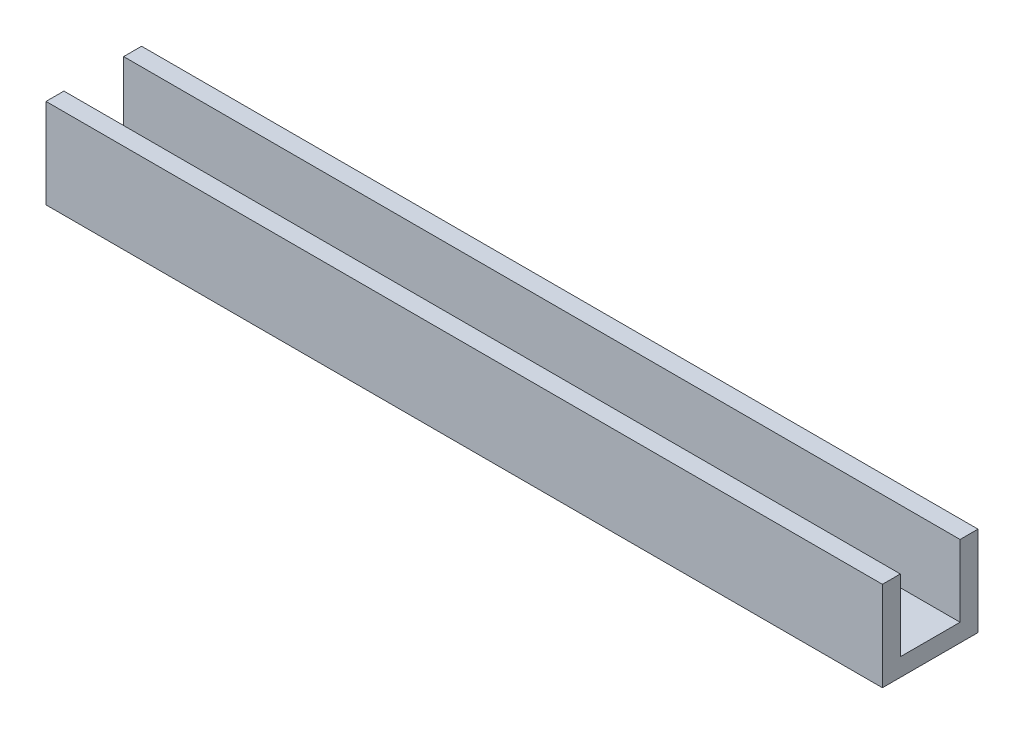
ISO-10303-21;
HEADER;
FILE_DESCRIPTION(('STEP AP214'),'2;1');
FILE_NAME('part.step','',(''),(''),'','','');
FILE_SCHEMA(('AUTOMOTIVE_DESIGN { 1 0 10303 214 1 1 1 1 }'));
ENDSEC;
DATA;
#1=APPLICATION_CONTEXT('core data for automotive mechanical design processes');
#2=APPLICATION_PROTOCOL_DEFINITION('international standard','automotive_design',2000,#1);
#3=PRODUCT_CONTEXT('',#1,'mechanical');
#4=PRODUCT('Part','Part','',(#3));
#5=PRODUCT_RELATED_PRODUCT_CATEGORY('part','',(#4));
#6=PRODUCT_DEFINITION_FORMATION('','',#4);
#7=PRODUCT_DEFINITION_CONTEXT('part definition',#1,'design');
#8=PRODUCT_DEFINITION('design','',#6,#7);
#9=PRODUCT_DEFINITION_SHAPE('','',#8);
#10=(LENGTH_UNIT() NAMED_UNIT(*) SI_UNIT(.MILLI.,.METRE.));
#11=(NAMED_UNIT(*) PLANE_ANGLE_UNIT() SI_UNIT($,.RADIAN.));
#12=(NAMED_UNIT(*) SI_UNIT($,.STERADIAN.) SOLID_ANGLE_UNIT());
#13=UNCERTAINTY_MEASURE_WITH_UNIT(LENGTH_MEASURE(1.E-05),#10,'distance_accuracy_value','');
#14=(GEOMETRIC_REPRESENTATION_CONTEXT(3) GLOBAL_UNCERTAINTY_ASSIGNED_CONTEXT((#13)) GLOBAL_UNIT_ASSIGNED_CONTEXT((#10,
#11,#12)) REPRESENTATION_CONTEXT('',''));
#15=CARTESIAN_POINT('',(0.,0.,0.));
#16=DIRECTION('',(0.,0.,1.));
#17=DIRECTION('',(1.,0.,0.));
#18=AXIS2_PLACEMENT_3D('',#15,#16,#17);
#19=CARTESIAN_POINT('',(70.,3.,0.));
#20=DIRECTION('',(-1.,0.,0.));
#21=DIRECTION('',(0.,0.,1.));
#22=AXIS2_PLACEMENT_3D('',#19,#20,#21);
#23=PLANE('',#22);
#24=DIRECTION('',(0.,0.,-1.));
#25=VECTOR('',#24,1.);
#26=CARTESIAN_POINT('',(70.,0.,0.));
#27=LINE('',#26,#25);
#28=CARTESIAN_POINT('',(70.,0.,8.));
#29=VERTEX_POINT('',#28);
#30=CARTESIAN_POINT('',(70.,0.,-8.));
#31=VERTEX_POINT('',#30);
#32=EDGE_CURVE('E182',#29,#31,#27,.T.);
#33=ORIENTED_EDGE('',*,*,#32,.T.);
#34=DIRECTION('',(0.,-1.,0.));
#35=VECTOR('',#34,1.);
#36=CARTESIAN_POINT('',(70.,15.,-8.));
#37=LINE('',#36,#35);
#38=CARTESIAN_POINT('',(70.,15.,-8.));
#39=VERTEX_POINT('',#38);
#40=EDGE_CURVE('E116',#39,#31,#37,.T.);
#41=ORIENTED_EDGE('',*,*,#40,.F.);
#42=DIRECTION('',(0.,0.,-1.));
#43=VECTOR('',#42,1.);
#44=CARTESIAN_POINT('',(70.,15.,0.));
#45=LINE('',#44,#43);
#46=CARTESIAN_POINT('',(70.,15.,-5.));
#47=VERTEX_POINT('',#46);
#48=EDGE_CURVE('E119',#47,#39,#45,.T.);
#49=ORIENTED_EDGE('',*,*,#48,.F.);
#50=DIRECTION('',(0.,-1.,0.));
#51=VECTOR('',#50,1.);
#52=CARTESIAN_POINT('',(70.,15.,-5.));
#53=LINE('',#52,#51);
#54=CARTESIAN_POINT('',(70.,3.,-5.));
#55=VERTEX_POINT('',#54);
#56=EDGE_CURVE('E107',#47,#55,#53,.T.);
#57=ORIENTED_EDGE('',*,*,#56,.T.);
#58=DIRECTION('',(0.,0.,-1.));
#59=VECTOR('',#58,1.);
#60=CARTESIAN_POINT('',(70.,3.,0.));
#61=LINE('',#60,#59);
#62=CARTESIAN_POINT('',(70.,3.,5.));
#63=VERTEX_POINT('',#62);
#64=EDGE_CURVE('E58',#63,#55,#61,.T.);
#65=ORIENTED_EDGE('',*,*,#64,.F.);
#66=DIRECTION('',(0.,-1.,0.));
#67=VECTOR('',#66,1.);
#68=CARTESIAN_POINT('',(70.,15.,5.));
#69=LINE('',#68,#67);
#70=CARTESIAN_POINT('',(70.,15.,5.));
#71=VERTEX_POINT('',#70);
#72=EDGE_CURVE('E178',#71,#63,#69,.T.);
#73=ORIENTED_EDGE('',*,*,#72,.F.);
#74=DIRECTION('',(0.,0.,-1.));
#75=VECTOR('',#74,1.);
#76=CARTESIAN_POINT('',(70.,15.,0.));
#77=LINE('',#76,#75);
#78=CARTESIAN_POINT('',(70.,15.,8.));
#79=VERTEX_POINT('',#78);
#80=EDGE_CURVE('E148',#79,#71,#77,.T.);
#81=ORIENTED_EDGE('',*,*,#80,.F.);
#82=DIRECTION('',(0.,-1.,0.));
#83=VECTOR('',#82,1.);
#84=CARTESIAN_POINT('',(70.,15.,8.));
#85=LINE('',#84,#83);
#86=EDGE_CURVE('E163',#79,#29,#85,.T.);
#87=ORIENTED_EDGE('',*,*,#86,.T.);
#88=EDGE_LOOP('',(#33,#41,#49,#57,#65,#73,#81,#87));
#89=FACE_BOUND('',#88,.T.);
#90=ADVANCED_FACE('F41',(#89),#23,.F.);
#91=CARTESIAN_POINT('',(-70.,3.,0.));
#92=DIRECTION('',(-1.,0.,0.));
#93=DIRECTION('',(0.,0.,1.));
#94=AXIS2_PLACEMENT_3D('',#91,#92,#93);
#95=PLANE('',#94);
#96=DIRECTION('',(0.,0.,-1.));
#97=VECTOR('',#96,1.);
#98=CARTESIAN_POINT('',(-70.,0.,0.));
#99=LINE('',#98,#97);
#100=CARTESIAN_POINT('',(-70.,0.,8.));
#101=VERTEX_POINT('',#100);
#102=CARTESIAN_POINT('',(-70.,0.,-8.));
#103=VERTEX_POINT('',#102);
#104=EDGE_CURVE('E44',#101,#103,#99,.T.);
#105=ORIENTED_EDGE('',*,*,#104,.F.);
#106=DIRECTION('',(0.,-1.,0.));
#107=VECTOR('',#106,1.);
#108=CARTESIAN_POINT('',(-70.,15.,8.));
#109=LINE('',#108,#107);
#110=CARTESIAN_POINT('',(-70.,15.,8.));
#111=VERTEX_POINT('',#110);
#112=EDGE_CURVE('E170',#111,#101,#109,.T.);
#113=ORIENTED_EDGE('',*,*,#112,.F.);
#114=DIRECTION('',(0.,0.,-1.));
#115=VECTOR('',#114,1.);
#116=CARTESIAN_POINT('',(-70.,15.,0.));
#117=LINE('',#116,#115);
#118=CARTESIAN_POINT('',(-70.,15.,5.));
#119=VERTEX_POINT('',#118);
#120=EDGE_CURVE('E155',#111,#119,#117,.T.);
#121=ORIENTED_EDGE('',*,*,#120,.T.);
#122=DIRECTION('',(0.,-1.,0.));
#123=VECTOR('',#122,1.);
#124=CARTESIAN_POINT('',(-70.,15.,5.));
#125=LINE('',#124,#123);
#126=CARTESIAN_POINT('',(-70.,3.,5.));
#127=VERTEX_POINT('',#126);
#128=EDGE_CURVE('E174',#119,#127,#125,.T.);
#129=ORIENTED_EDGE('',*,*,#128,.T.);
#130=DIRECTION('',(0.,0.,-1.));
#131=VECTOR('',#130,1.);
#132=CARTESIAN_POINT('',(-70.,3.,0.));
#133=LINE('',#132,#131);
#134=CARTESIAN_POINT('',(-70.,3.,-5.));
#135=VERTEX_POINT('',#134);
#136=EDGE_CURVE('E50',#127,#135,#133,.T.);
#137=ORIENTED_EDGE('',*,*,#136,.T.);
#138=DIRECTION('',(0.,-1.,0.));
#139=VECTOR('',#138,1.);
#140=CARTESIAN_POINT('',(-70.,15.,-5.));
#141=LINE('',#140,#139);
#142=CARTESIAN_POINT('',(-70.,15.,-5.));
#143=VERTEX_POINT('',#142);
#144=EDGE_CURVE('E66',#143,#135,#141,.T.);
#145=ORIENTED_EDGE('',*,*,#144,.F.);
#146=DIRECTION('',(0.,0.,-1.));
#147=VECTOR('',#146,1.);
#148=CARTESIAN_POINT('',(-70.,15.,0.));
#149=LINE('',#148,#147);
#150=CARTESIAN_POINT('',(-70.,15.,-8.));
#151=VERTEX_POINT('',#150);
#152=EDGE_CURVE('E128',#143,#151,#149,.T.);
#153=ORIENTED_EDGE('',*,*,#152,.T.);
#154=DIRECTION('',(0.,-1.,0.));
#155=VECTOR('',#154,1.);
#156=CARTESIAN_POINT('',(-70.,15.,-8.));
#157=LINE('',#156,#155);
#158=EDGE_CURVE('E142',#151,#103,#157,.T.);
#159=ORIENTED_EDGE('',*,*,#158,.T.);
#160=EDGE_LOOP('',(#105,#113,#121,#129,#137,#145,#153,#159));
#161=FACE_BOUND('',#160,.T.);
#162=ADVANCED_FACE('F197',(#161),#95,.T.);
#163=CARTESIAN_POINT('',(0.,3.,0.));
#164=DIRECTION('',(0.,1.,0.));
#165=DIRECTION('',(0.,0.,1.));
#166=AXIS2_PLACEMENT_3D('',#163,#164,#165);
#167=PLANE('',#166);
#168=ORIENTED_EDGE('',*,*,#64,.T.);
#169=DIRECTION('',(-1.,0.,0.));
#170=VECTOR('',#169,1.);
#171=CARTESIAN_POINT('',(0.,3.,-5.));
#172=LINE('',#171,#170);
#173=EDGE_CURVE('E113',#55,#135,#172,.T.);
#174=ORIENTED_EDGE('',*,*,#173,.T.);
#175=ORIENTED_EDGE('',*,*,#136,.F.);
#176=DIRECTION('',(-1.,0.,0.));
#177=VECTOR('',#176,1.);
#178=CARTESIAN_POINT('',(0.,3.,5.));
#179=LINE('',#178,#177);
#180=EDGE_CURVE('E11',#63,#127,#179,.T.);
#181=ORIENTED_EDGE('',*,*,#180,.F.);
#182=EDGE_LOOP('',(#168,#174,#175,#181));
#183=FACE_BOUND('',#182,.T.);
#184=ADVANCED_FACE('F213',(#183),#167,.T.);
#185=CARTESIAN_POINT('',(0.,0.,0.));
#186=DIRECTION('',(0.,1.,0.));
#187=DIRECTION('',(0.,0.,1.));
#188=AXIS2_PLACEMENT_3D('',#185,#186,#187);
#189=PLANE('',#188);
#190=ORIENTED_EDGE('',*,*,#32,.F.);
#191=DIRECTION('',(-1.,0.,0.));
#192=VECTOR('',#191,1.);
#193=CARTESIAN_POINT('',(0.,0.,8.));
#194=LINE('',#193,#192);
#195=EDGE_CURVE('E115',#29,#101,#194,.T.);
#196=ORIENTED_EDGE('',*,*,#195,.T.);
#197=ORIENTED_EDGE('',*,*,#104,.T.);
#198=DIRECTION('',(-1.,0.,0.));
#199=VECTOR('',#198,1.);
#200=CARTESIAN_POINT('',(0.,0.,-8.));
#201=LINE('',#200,#199);
#202=EDGE_CURVE('E130',#31,#103,#201,.T.);
#203=ORIENTED_EDGE('',*,*,#202,.F.);
#204=EDGE_LOOP('',(#190,#196,#197,#203));
#205=FACE_BOUND('',#204,.T.);
#206=ADVANCED_FACE('F193',(#205),#189,.F.);
#207=CARTESIAN_POINT('',(0.,15.,5.));
#208=DIRECTION('',(0.,0.,1.));
#209=DIRECTION('',(1.,0.,0.));
#210=AXIS2_PLACEMENT_3D('',#207,#208,#209);
#211=PLANE('',#210);
#212=ORIENTED_EDGE('',*,*,#72,.T.);
#213=ORIENTED_EDGE('',*,*,#180,.T.);
#214=ORIENTED_EDGE('',*,*,#128,.F.);
#215=DIRECTION('',(-1.,0.,0.));
#216=VECTOR('',#215,1.);
#217=CARTESIAN_POINT('',(0.,15.,5.));
#218=LINE('',#217,#216);
#219=EDGE_CURVE('E152',#71,#119,#218,.T.);
#220=ORIENTED_EDGE('',*,*,#219,.F.);
#221=EDGE_LOOP('',(#212,#213,#214,#220));
#222=FACE_BOUND('',#221,.T.);
#223=ADVANCED_FACE('F221',(#222),#211,.F.);
#224=CARTESIAN_POINT('',(0.,15.,8.));
#225=DIRECTION('',(0.,0.,1.));
#226=DIRECTION('',(1.,0.,0.));
#227=AXIS2_PLACEMENT_3D('',#224,#225,#226);
#228=PLANE('',#227);
#229=ORIENTED_EDGE('',*,*,#195,.F.);
#230=ORIENTED_EDGE('',*,*,#86,.F.);
#231=DIRECTION('',(-1.,0.,0.));
#232=VECTOR('',#231,1.);
#233=CARTESIAN_POINT('',(0.,15.,8.));
#234=LINE('',#233,#232);
#235=EDGE_CURVE('E159',#79,#111,#234,.T.);
#236=ORIENTED_EDGE('',*,*,#235,.T.);
#237=ORIENTED_EDGE('',*,*,#112,.T.);
#238=EDGE_LOOP('',(#229,#230,#236,#237));
#239=FACE_BOUND('',#238,.T.);
#240=ADVANCED_FACE('F225',(#239),#228,.T.);
#241=CARTESIAN_POINT('',(0.,15.,0.));
#242=DIRECTION('',(0.,1.,0.));
#243=DIRECTION('',(0.,0.,1.));
#244=AXIS2_PLACEMENT_3D('',#241,#242,#243);
#245=PLANE('',#244);
#246=ORIENTED_EDGE('',*,*,#80,.T.);
#247=ORIENTED_EDGE('',*,*,#219,.T.);
#248=ORIENTED_EDGE('',*,*,#120,.F.);
#249=ORIENTED_EDGE('',*,*,#235,.F.);
#250=EDGE_LOOP('',(#246,#247,#248,#249));
#251=FACE_BOUND('',#250,.T.);
#252=ADVANCED_FACE('F207',(#251),#245,.T.);
#253=CARTESIAN_POINT('',(0.,15.,-5.));
#254=DIRECTION('',(0.,0.,1.));
#255=DIRECTION('',(1.,0.,0.));
#256=AXIS2_PLACEMENT_3D('',#253,#254,#255);
#257=PLANE('',#256);
#258=ORIENTED_EDGE('',*,*,#173,.F.);
#259=ORIENTED_EDGE('',*,*,#56,.F.);
#260=DIRECTION('',(-1.,0.,0.));
#261=VECTOR('',#260,1.);
#262=CARTESIAN_POINT('',(0.,15.,-5.));
#263=LINE('',#262,#261);
#264=EDGE_CURVE('E111',#47,#143,#263,.T.);
#265=ORIENTED_EDGE('',*,*,#264,.T.);
#266=ORIENTED_EDGE('',*,*,#144,.T.);
#267=EDGE_LOOP('',(#258,#259,#265,#266));
#268=FACE_BOUND('',#267,.T.);
#269=ADVANCED_FACE('F109',(#268),#257,.T.);
#270=CARTESIAN_POINT('',(0.,15.,-8.));
#271=DIRECTION('',(0.,0.,1.));
#272=DIRECTION('',(1.,0.,0.));
#273=AXIS2_PLACEMENT_3D('',#270,#271,#272);
#274=PLANE('',#273);
#275=ORIENTED_EDGE('',*,*,#202,.T.);
#276=ORIENTED_EDGE('',*,*,#158,.F.);
#277=DIRECTION('',(-1.,0.,0.));
#278=VECTOR('',#277,1.);
#279=CARTESIAN_POINT('',(0.,15.,-8.));
#280=LINE('',#279,#278);
#281=EDGE_CURVE('E124',#39,#151,#280,.T.);
#282=ORIENTED_EDGE('',*,*,#281,.F.);
#283=ORIENTED_EDGE('',*,*,#40,.T.);
#284=EDGE_LOOP('',(#275,#276,#282,#283));
#285=FACE_BOUND('',#284,.T.);
#286=ADVANCED_FACE('F199',(#285),#274,.F.);
#287=CARTESIAN_POINT('',(0.,15.,0.));
#288=DIRECTION('',(0.,1.,0.));
#289=DIRECTION('',(0.,0.,1.));
#290=AXIS2_PLACEMENT_3D('',#287,#288,#289);
#291=PLANE('',#290);
#292=ORIENTED_EDGE('',*,*,#264,.F.);
#293=ORIENTED_EDGE('',*,*,#48,.T.);
#294=ORIENTED_EDGE('',*,*,#281,.T.);
#295=ORIENTED_EDGE('',*,*,#152,.F.);
#296=EDGE_LOOP('',(#292,#293,#294,#295));
#297=FACE_BOUND('',#296,.T.);
#298=ADVANCED_FACE('F126',(#297),#291,.T.);
#299=CLOSED_SHELL('',(#90,#162,#184,#206,#223,#240,#252,#269,#286,#298));
#300=MANIFOLD_SOLID_BREP('B2',#299);
#301=ADVANCED_BREP_SHAPE_REPRESENTATION('',(#18,#300),#14);
#302=SHAPE_DEFINITION_REPRESENTATION(#9,#301);
ENDSEC;
END-ISO-10303-21;
